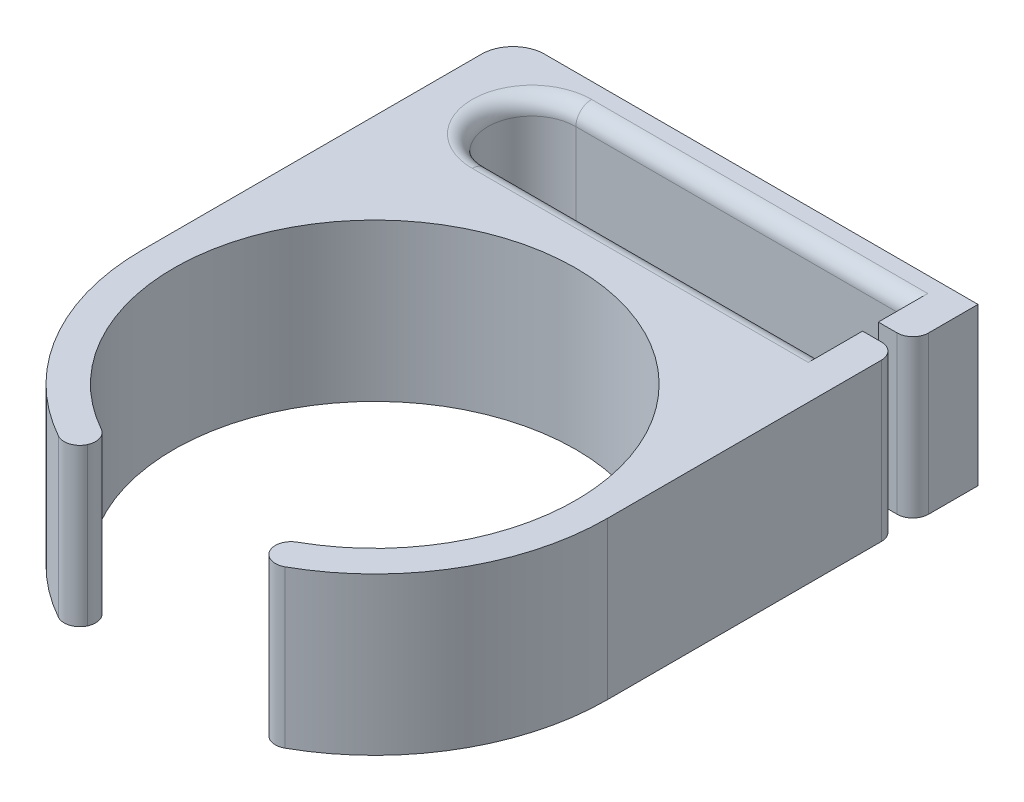
ISO-10303-21;
HEADER;
FILE_DESCRIPTION(('STEP AP214'),'2;1');
FILE_NAME('part.step','',(''),(''),'','','');
FILE_SCHEMA(('AUTOMOTIVE_DESIGN { 1 0 10303 214 1 1 1 1 }'));
ENDSEC;
DATA;
#1=APPLICATION_CONTEXT('core data for automotive mechanical design processes');
#2=APPLICATION_PROTOCOL_DEFINITION('international standard','automotive_design',2000,#1);
#3=PRODUCT_CONTEXT('',#1,'mechanical');
#4=PRODUCT('Part','Part','',(#3));
#5=PRODUCT_RELATED_PRODUCT_CATEGORY('part','',(#4));
#6=PRODUCT_DEFINITION_FORMATION('','',#4);
#7=PRODUCT_DEFINITION_CONTEXT('part definition',#1,'design');
#8=PRODUCT_DEFINITION('design','',#6,#7);
#9=PRODUCT_DEFINITION_SHAPE('','',#8);
#10=(LENGTH_UNIT() NAMED_UNIT(*) SI_UNIT(.MILLI.,.METRE.));
#11=(NAMED_UNIT(*) PLANE_ANGLE_UNIT() SI_UNIT($,.RADIAN.));
#12=(NAMED_UNIT(*) SI_UNIT($,.STERADIAN.) SOLID_ANGLE_UNIT());
#13=UNCERTAINTY_MEASURE_WITH_UNIT(LENGTH_MEASURE(1.E-05),#10,'distance_accuracy_value','');
#14=(GEOMETRIC_REPRESENTATION_CONTEXT(3) GLOBAL_UNCERTAINTY_ASSIGNED_CONTEXT((#13)) GLOBAL_UNIT_ASSIGNED_CONTEXT((#10,
#11,#12)) REPRESENTATION_CONTEXT('',''));
#15=CARTESIAN_POINT('',(0.,0.,0.));
#16=DIRECTION('',(0.,0.,1.));
#17=DIRECTION('',(1.,0.,0.));
#18=AXIS2_PLACEMENT_3D('',#15,#16,#17);
#19=CARTESIAN_POINT('',(0.,10.,-21.6));
#20=DIRECTION('',(0.,0.,1.));
#21=DIRECTION('',(1.,0.,0.));
#22=AXIS2_PLACEMENT_3D('',#19,#20,#21);
#23=PLANE('',#22);
#24=DIRECTION('',(0.,-1.,0.));
#25=VECTOR('',#24,1.);
#26=CARTESIAN_POINT('',(-8.8,10.,-21.6));
#27=LINE('',#26,#25);
#28=CARTESIAN_POINT('',(-8.8,9.,-21.6));
#29=VERTEX_POINT('',#28);
#30=CARTESIAN_POINT('',(-8.8,0.999999999999999,-21.6));
#31=VERTEX_POINT('',#30);
#32=EDGE_CURVE('E275',#29,#31,#27,.T.);
#33=ORIENTED_EDGE('',*,*,#32,.T.);
#34=DIRECTION('',(-1.,0.,0.));
#35=VECTOR('',#34,1.);
#36=CARTESIAN_POINT('',(12.6,1.,-21.6));
#37=LINE('',#36,#35);
#38=CARTESIAN_POINT('',(12.6,0.999999999999999,-21.6));
#39=VERTEX_POINT('',#38);
#40=EDGE_CURVE('E381',#31,#39,#37,.F.);
#41=ORIENTED_EDGE('',*,*,#40,.T.);
#42=DIRECTION('',(0.,-1.,0.));
#43=VECTOR('',#42,1.);
#44=CARTESIAN_POINT('',(12.6,10.,-21.6));
#45=LINE('',#44,#43);
#46=CARTESIAN_POINT('',(12.6,9.,-21.6));
#47=VERTEX_POINT('',#46);
#48=EDGE_CURVE('E232',#47,#39,#45,.T.);
#49=ORIENTED_EDGE('',*,*,#48,.F.);
#50=DIRECTION('',(-1.,0.,0.));
#51=VECTOR('',#50,1.);
#52=CARTESIAN_POINT('',(0.,9.,-21.6));
#53=LINE('',#52,#51);
#54=EDGE_CURVE('E377',#47,#29,#53,.T.);
#55=ORIENTED_EDGE('',*,*,#54,.T.);
#56=EDGE_LOOP('',(#33,#41,#49,#55));
#57=FACE_BOUND('',#56,.T.);
#58=ADVANCED_FACE('F41',(#57),#23,.T.);
#59=CARTESIAN_POINT('',(12.6,10.,0.));
#60=DIRECTION('',(-1.,0.,0.));
#61=DIRECTION('',(0.,0.,1.));
#62=AXIS2_PLACEMENT_3D('',#59,#60,#61);
#63=PLANE('',#62);
#64=DIRECTION('',(0.,0.,-1.));
#65=VECTOR('',#64,1.);
#66=CARTESIAN_POINT('',(12.6,0.,0.));
#67=LINE('',#66,#65);
#68=CARTESIAN_POINT('',(12.6,0.,-19.4531602214473));
#69=VERTEX_POINT('',#68);
#70=CARTESIAN_POINT('',(12.6,0.,-22.6));
#71=VERTEX_POINT('',#70);
#72=EDGE_CURVE('E230',#69,#71,#67,.T.);
#73=ORIENTED_EDGE('',*,*,#72,.F.);
#74=DIRECTION('',(0.,-1.,0.));
#75=VECTOR('',#74,1.);
#76=CARTESIAN_POINT('',(12.6,10.,-19.4531602214473));
#77=LINE('',#76,#75);
#78=CARTESIAN_POINT('',(12.6,10.,-19.4531602214473));
#79=VERTEX_POINT('',#78);
#80=EDGE_CURVE('E215',#79,#69,#77,.T.);
#81=ORIENTED_EDGE('',*,*,#80,.F.);
#82=DIRECTION('',(0.,0.,-1.));
#83=VECTOR('',#82,1.);
#84=CARTESIAN_POINT('',(12.6,10.,0.));
#85=LINE('',#84,#83);
#86=CARTESIAN_POINT('',(12.6,10.,-22.6));
#87=VERTEX_POINT('',#86);
#88=EDGE_CURVE('E224',#79,#87,#85,.T.);
#89=ORIENTED_EDGE('',*,*,#88,.T.);
#90=CARTESIAN_POINT('',(12.6,9.,-22.6));
#91=DIRECTION('',(-1.,0.,0.));
#92=DIRECTION('',(0.,0.,1.));
#93=AXIS2_PLACEMENT_3D('',#90,#91,#92);
#94=CIRCLE('',#93,1.);
#95=EDGE_CURVE('E451',#87,#47,#94,.F.);
#96=ORIENTED_EDGE('',*,*,#95,.T.);
#97=ORIENTED_EDGE('',*,*,#48,.T.);
#98=CARTESIAN_POINT('',(12.6,1.,-22.6));
#99=DIRECTION('',(-1.,0.,0.));
#100=DIRECTION('',(0.,0.,1.));
#101=AXIS2_PLACEMENT_3D('',#98,#99,#100);
#102=CIRCLE('',#101,1.);
#103=EDGE_CURVE('E448',#39,#71,#102,.F.);
#104=ORIENTED_EDGE('',*,*,#103,.T.);
#105=EDGE_LOOP('',(#73,#81,#89,#96,#97,#104));
#106=FACE_BOUND('',#105,.T.);
#107=ADVANCED_FACE('F227',(#106),#63,.T.);
#108=CARTESIAN_POINT('',(0.,10.,-19.4531602214473));
#109=DIRECTION('',(0.,0.,1.));
#110=DIRECTION('',(1.,0.,0.));
#111=AXIS2_PLACEMENT_3D('',#108,#109,#110);
#112=PLANE('',#111);
#113=DIRECTION('',(-1.,0.,0.));
#114=VECTOR('',#113,1.);
#115=CARTESIAN_POINT('',(0.,0.,-19.4531602214473));
#116=LINE('',#115,#114);
#117=CARTESIAN_POINT('',(13.8,0.,-19.4531602214473));
#118=VERTEX_POINT('',#117);
#119=EDGE_CURVE('E278',#118,#69,#116,.T.);
#120=ORIENTED_EDGE('',*,*,#119,.F.);
#121=DIRECTION('',(0.,-1.,0.));
#122=VECTOR('',#121,1.);
#123=CARTESIAN_POINT('',(13.8,10.,-19.4531602214473));
#124=LINE('',#123,#122);
#125=CARTESIAN_POINT('',(13.8,10.,-19.4531602214473));
#126=VERTEX_POINT('',#125);
#127=EDGE_CURVE('E218',#118,#126,#124,.F.);
#128=ORIENTED_EDGE('',*,*,#127,.T.);
#129=DIRECTION('',(-1.,0.,0.));
#130=VECTOR('',#129,1.);
#131=CARTESIAN_POINT('',(0.,10.,-19.4531602214473));
#132=LINE('',#131,#130);
#133=EDGE_CURVE('E211',#126,#79,#132,.T.);
#134=ORIENTED_EDGE('',*,*,#133,.T.);
#135=ORIENTED_EDGE('',*,*,#80,.T.);
#136=EDGE_LOOP('',(#120,#128,#134,#135));
#137=FACE_BOUND('',#136,.T.);
#138=ADVANCED_FACE('F214',(#137),#112,.T.);
#139=CARTESIAN_POINT('',(14.8,10.,0.));
#140=DIRECTION('',(1.,0.,0.));
#141=DIRECTION('',(0.,0.,-1.));
#142=AXIS2_PLACEMENT_3D('',#139,#140,#141);
#143=PLANE('',#142);
#144=DIRECTION('',(0.,0.,1.));
#145=VECTOR('',#144,1.);
#146=CARTESIAN_POINT('',(14.8,10.,0.));
#147=LINE('',#146,#145);
#148=CARTESIAN_POINT('',(14.8,10.,-23.6));
#149=VERTEX_POINT('',#148);
#150=CARTESIAN_POINT('',(14.8,10.,-20.4531602214473));
#151=VERTEX_POINT('',#150);
#152=EDGE_CURVE('E223',#149,#151,#147,.T.);
#153=ORIENTED_EDGE('',*,*,#152,.T.);
#154=DIRECTION('',(0.,-1.,0.));
#155=VECTOR('',#154,1.);
#156=CARTESIAN_POINT('',(14.8,10.,-20.4531602214473));
#157=LINE('',#156,#155);
#158=CARTESIAN_POINT('',(14.8,0.,-20.4531602214473));
#159=VERTEX_POINT('',#158);
#160=EDGE_CURVE('E421',#151,#159,#157,.T.);
#161=ORIENTED_EDGE('',*,*,#160,.T.);
#162=DIRECTION('',(0.,0.,1.));
#163=VECTOR('',#162,1.);
#164=CARTESIAN_POINT('',(14.8,0.,0.));
#165=LINE('',#164,#163);
#166=CARTESIAN_POINT('',(14.8,0.,-23.6));
#167=VERTEX_POINT('',#166);
#168=EDGE_CURVE('E282',#167,#159,#165,.T.);
#169=ORIENTED_EDGE('',*,*,#168,.F.);
#170=DIRECTION('',(0.,-1.,0.));
#171=VECTOR('',#170,1.);
#172=CARTESIAN_POINT('',(14.8,10.,-23.6));
#173=LINE('',#172,#171);
#174=EDGE_CURVE('E233',#149,#167,#173,.T.);
#175=ORIENTED_EDGE('',*,*,#174,.F.);
#176=EDGE_LOOP('',(#153,#161,#169,#175));
#177=FACE_BOUND('',#176,.T.);
#178=ADVANCED_FACE('F556',(#177),#143,.T.);
#179=CARTESIAN_POINT('',(0.,10.,-23.6));
#180=DIRECTION('',(0.,0.,-1.));
#181=DIRECTION('',(-1.,0.,0.));
#182=AXIS2_PLACEMENT_3D('',#179,#180,#181);
#183=PLANE('',#182);
#184=DIRECTION('',(1.,0.,0.));
#185=VECTOR('',#184,1.);
#186=CARTESIAN_POINT('',(0.,0.,-23.6));
#187=LINE('',#186,#185);
#188=CARTESIAN_POINT('',(-12.8,0.,-23.6));
#189=VERTEX_POINT('',#188);
#190=EDGE_CURVE('E286',#189,#167,#187,.T.);
#191=ORIENTED_EDGE('',*,*,#190,.F.);
#192=DIRECTION('',(0.,-1.,0.));
#193=VECTOR('',#192,1.);
#194=CARTESIAN_POINT('',(-12.8,10.,-23.6));
#195=LINE('',#194,#193);
#196=CARTESIAN_POINT('',(-12.8,10.,-23.6));
#197=VERTEX_POINT('',#196);
#198=EDGE_CURVE('E342',#189,#197,#195,.F.);
#199=ORIENTED_EDGE('',*,*,#198,.T.);
#200=DIRECTION('',(1.,0.,0.));
#201=VECTOR('',#200,1.);
#202=CARTESIAN_POINT('',(0.,10.,-23.6));
#203=LINE('',#202,#201);
#204=EDGE_CURVE('E249',#197,#149,#203,.T.);
#205=ORIENTED_EDGE('',*,*,#204,.T.);
#206=ORIENTED_EDGE('',*,*,#174,.T.);
#207=EDGE_LOOP('',(#191,#199,#205,#206));
#208=FACE_BOUND('',#207,.T.);
#209=ADVANCED_FACE('F560',(#208),#183,.T.);
#210=CARTESIAN_POINT('',(-14.8,10.,0.));
#211=DIRECTION('',(-1.,0.,0.));
#212=DIRECTION('',(0.,0.,1.));
#213=AXIS2_PLACEMENT_3D('',#210,#211,#212);
#214=PLANE('',#213);
#215=DIRECTION('',(0.,0.,-1.));
#216=VECTOR('',#215,1.);
#217=CARTESIAN_POINT('',(-14.8,10.,0.));
#218=LINE('',#217,#216);
#219=CARTESIAN_POINT('',(-14.8,10.,0.));
#220=VERTEX_POINT('',#219);
#221=CARTESIAN_POINT('',(-14.8,10.,-21.6));
#222=VERTEX_POINT('',#221);
#223=EDGE_CURVE('E252',#220,#222,#218,.T.);
#224=ORIENTED_EDGE('',*,*,#223,.T.);
#225=DIRECTION('',(0.,-1.,0.));
#226=VECTOR('',#225,1.);
#227=CARTESIAN_POINT('',(-14.8,10.,-21.6));
#228=LINE('',#227,#226);
#229=CARTESIAN_POINT('',(-14.8,0.,-21.6));
#230=VERTEX_POINT('',#229);
#231=EDGE_CURVE('E335',#222,#230,#228,.T.);
#232=ORIENTED_EDGE('',*,*,#231,.T.);
#233=DIRECTION('',(0.,0.,-1.));
#234=VECTOR('',#233,1.);
#235=CARTESIAN_POINT('',(-14.8,0.,0.));
#236=LINE('',#235,#234);
#237=CARTESIAN_POINT('',(-14.8,0.,0.));
#238=VERTEX_POINT('',#237);
#239=EDGE_CURVE('E289',#238,#230,#236,.T.);
#240=ORIENTED_EDGE('',*,*,#239,.F.);
#241=DIRECTION('',(0.,-1.,0.));
#242=VECTOR('',#241,1.);
#243=CARTESIAN_POINT('',(-14.8,10.,0.));
#244=LINE('',#243,#242);
#245=EDGE_CURVE('E326',#220,#238,#244,.T.);
#246=ORIENTED_EDGE('',*,*,#245,.F.);
#247=EDGE_LOOP('',(#224,#232,#240,#246));
#248=FACE_BOUND('',#247,.T.);
#249=ADVANCED_FACE('F569',(#248),#214,.T.);
#250=CARTESIAN_POINT('',(0.,10.,0.));
#251=DIRECTION('',(0.,-1.,0.));
#252=DIRECTION('',(0.,0.,-1.));
#253=AXIS2_PLACEMENT_3D('',#250,#251,#252);
#254=CYLINDRICAL_SURFACE('',#253,14.8);
#255=CARTESIAN_POINT('',(0.,0.,0.));
#256=DIRECTION('',(0.,1.,0.));
#257=DIRECTION('',(0.,0.,1.));
#258=AXIS2_PLACEMENT_3D('',#255,#256,#257);
#259=CIRCLE('',#258,14.8);
#260=CARTESIAN_POINT('',(-7.21028908395557,0.,12.9248493734276));
#261=VERTEX_POINT('',#260);
#262=EDGE_CURVE('E293',#238,#261,#259,.T.);
#263=ORIENTED_EDGE('',*,*,#262,.T.);
#264=DIRECTION('',(0.,-1.,0.));
#265=VECTOR('',#264,1.);
#266=CARTESIAN_POINT('',(-7.21028908395557,10.,12.9248493734276));
#267=LINE('',#266,#265);
#268=CARTESIAN_POINT('',(-7.21028908395557,10.,12.9248493734276));
#269=VERTEX_POINT('',#268);
#270=EDGE_CURVE('E444',#261,#269,#267,.F.);
#271=ORIENTED_EDGE('',*,*,#270,.T.);
#272=CARTESIAN_POINT('',(0.,10.,0.));
#273=DIRECTION('',(0.,1.,0.));
#274=DIRECTION('',(0.,0.,1.));
#275=AXIS2_PLACEMENT_3D('',#272,#273,#274);
#276=CIRCLE('',#275,14.8);
#277=EDGE_CURVE('E256',#220,#269,#276,.T.);
#278=ORIENTED_EDGE('',*,*,#277,.F.);
#279=ORIENTED_EDGE('',*,*,#245,.T.);
#280=EDGE_LOOP('',(#263,#271,#278,#279));
#281=FACE_BOUND('',#280,.T.);
#282=ADVANCED_FACE('F572',(#281),#254,.T.);
#283=CARTESIAN_POINT('',(0.,10.,0.));
#284=DIRECTION('',(0.,-1.,0.));
#285=DIRECTION('',(0.,0.,-1.));
#286=AXIS2_PLACEMENT_3D('',#283,#284,#285);
#287=CYLINDRICAL_SURFACE('',#286,12.8);
#288=CARTESIAN_POINT('',(0.,0.,0.));
#289=DIRECTION('',(0.,1.,0.));
#290=DIRECTION('',(0.,0.,1.));
#291=AXIS2_PLACEMENT_3D('',#288,#289,#290);
#292=CIRCLE('',#291,12.8);
#293=CARTESIAN_POINT('',(6.23592569423185,0.,11.1782481067482));
#294=VERTEX_POINT('',#293);
#295=CARTESIAN_POINT('',(-6.23592569423184,0.,11.1782481067482));
#296=VERTEX_POINT('',#295);
#297=EDGE_CURVE('E297',#294,#296,#292,.T.);
#298=ORIENTED_EDGE('',*,*,#297,.F.);
#299=DIRECTION('',(0.,-1.,0.));
#300=VECTOR('',#299,1.);
#301=CARTESIAN_POINT('',(6.23592569423185,10.,11.1782481067482));
#302=LINE('',#301,#300);
#303=CARTESIAN_POINT('',(6.23592569423185,10.,11.1782481067482));
#304=VERTEX_POINT('',#303);
#305=EDGE_CURVE('E437',#294,#304,#302,.F.);
#306=ORIENTED_EDGE('',*,*,#305,.T.);
#307=CARTESIAN_POINT('',(0.,10.,0.));
#308=DIRECTION('',(0.,1.,0.));
#309=DIRECTION('',(0.,0.,1.));
#310=AXIS2_PLACEMENT_3D('',#307,#308,#309);
#311=CIRCLE('',#310,12.8);
#312=CARTESIAN_POINT('',(-6.23592569423184,10.,11.1782481067482));
#313=VERTEX_POINT('',#312);
#314=EDGE_CURVE('E260',#304,#313,#311,.T.);
#315=ORIENTED_EDGE('',*,*,#314,.T.);
#316=DIRECTION('',(0.,-1.,0.));
#317=VECTOR('',#316,1.);
#318=CARTESIAN_POINT('',(-6.23592569423184,10.,11.1782481067482));
#319=LINE('',#318,#317);
#320=EDGE_CURVE('E434',#313,#296,#319,.T.);
#321=ORIENTED_EDGE('',*,*,#320,.T.);
#322=EDGE_LOOP('',(#298,#306,#315,#321));
#323=FACE_BOUND('',#322,.T.);
#324=ADVANCED_FACE('F488',(#323),#287,.F.);
#325=CARTESIAN_POINT('',(7.21028908395558,10.,12.9248493734276));
#326=VERTEX_POINT('',#325);
#327=CARTESIAN_POINT('',(14.8,10.,0.));
#328=VERTEX_POINT('',#327);
#329=EDGE_CURVE('E261',#326,#328,#276,.T.);
#330=ORIENTED_EDGE('',*,*,#329,.F.);
#331=DIRECTION('',(0.,-1.,0.));
#332=VECTOR('',#331,1.);
#333=CARTESIAN_POINT('',(7.21028908395558,10.,12.9248493734276));
#334=LINE('',#333,#332);
#335=CARTESIAN_POINT('',(7.21028908395558,0.,12.9248493734276));
#336=VERTEX_POINT('',#335);
#337=EDGE_CURVE('E441',#326,#336,#334,.T.);
#338=ORIENTED_EDGE('',*,*,#337,.T.);
#339=CARTESIAN_POINT('',(14.8,0.,0.));
#340=VERTEX_POINT('',#339);
#341=EDGE_CURVE('E298',#336,#340,#259,.T.);
#342=ORIENTED_EDGE('',*,*,#341,.T.);
#343=DIRECTION('',(0.,-1.,0.));
#344=VECTOR('',#343,1.);
#345=CARTESIAN_POINT('',(14.8,10.,0.));
#346=LINE('',#345,#344);
#347=EDGE_CURVE('E322',#328,#340,#346,.T.);
#348=ORIENTED_EDGE('',*,*,#347,.F.);
#349=EDGE_LOOP('',(#330,#338,#342,#348));
#350=FACE_BOUND('',#349,.T.);
#351=ADVANCED_FACE('F499',(#350),#254,.T.);
#352=CARTESIAN_POINT('',(14.8,10.,0.));
#353=DIRECTION('',(-1.,0.,0.));
#354=DIRECTION('',(0.,0.,1.));
#355=AXIS2_PLACEMENT_3D('',#352,#353,#354);
#356=PLANE('',#355);
#357=DIRECTION('',(0.,0.,-1.));
#358=VECTOR('',#357,1.);
#359=CARTESIAN_POINT('',(14.8,0.,0.));
#360=LINE('',#359,#358);
#361=CARTESIAN_POINT('',(14.8,0.,-17.4531602214473));
#362=VERTEX_POINT('',#361);
#363=EDGE_CURVE('E302',#340,#362,#360,.T.);
#364=ORIENTED_EDGE('',*,*,#363,.T.);
#365=DIRECTION('',(0.,-1.,0.));
#366=VECTOR('',#365,1.);
#367=CARTESIAN_POINT('',(14.8,10.,-17.4531602214473));
#368=LINE('',#367,#366);
#369=CARTESIAN_POINT('',(14.8,10.,-17.4531602214473));
#370=VERTEX_POINT('',#369);
#371=EDGE_CURVE('E431',#362,#370,#368,.F.);
#372=ORIENTED_EDGE('',*,*,#371,.T.);
#373=DIRECTION('',(0.,0.,-1.));
#374=VECTOR('',#373,1.);
#375=CARTESIAN_POINT('',(14.8,10.,0.));
#376=LINE('',#375,#374);
#377=EDGE_CURVE('E265',#328,#370,#376,.T.);
#378=ORIENTED_EDGE('',*,*,#377,.F.);
#379=ORIENTED_EDGE('',*,*,#347,.T.);
#380=EDGE_LOOP('',(#364,#372,#378,#379));
#381=FACE_BOUND('',#380,.T.);
#382=ADVANCED_FACE('F508',(#381),#356,.F.);
#383=CARTESIAN_POINT('',(0.,10.,-18.4531602214473));
#384=DIRECTION('',(0.,0.,1.));
#385=DIRECTION('',(1.,0.,0.));
#386=AXIS2_PLACEMENT_3D('',#383,#384,#385);
#387=PLANE('',#386);
#388=DIRECTION('',(-1.,0.,0.));
#389=VECTOR('',#388,1.);
#390=CARTESIAN_POINT('',(0.,10.,-18.4531602214473));
#391=LINE('',#390,#389);
#392=CARTESIAN_POINT('',(13.8,10.,-18.4531602214473));
#393=VERTEX_POINT('',#392);
#394=CARTESIAN_POINT('',(12.6,10.,-18.4531602214473));
#395=VERTEX_POINT('',#394);
#396=EDGE_CURVE('E269',#393,#395,#391,.T.);
#397=ORIENTED_EDGE('',*,*,#396,.F.);
#398=DIRECTION('',(0.,-1.,0.));
#399=VECTOR('',#398,1.);
#400=CARTESIAN_POINT('',(13.8,10.,-18.4531602214473));
#401=LINE('',#400,#399);
#402=CARTESIAN_POINT('',(13.8,0.,-18.4531602214473));
#403=VERTEX_POINT('',#402);
#404=EDGE_CURVE('E427',#393,#403,#401,.T.);
#405=ORIENTED_EDGE('',*,*,#404,.T.);
#406=DIRECTION('',(-1.,0.,0.));
#407=VECTOR('',#406,1.);
#408=CARTESIAN_POINT('',(0.,0.,-18.4531602214473));
#409=LINE('',#408,#407);
#410=CARTESIAN_POINT('',(12.6,0.,-18.4531602214473));
#411=VERTEX_POINT('',#410);
#412=EDGE_CURVE('E243',#403,#411,#409,.T.);
#413=ORIENTED_EDGE('',*,*,#412,.T.);
#414=DIRECTION('',(0.,-1.,0.));
#415=VECTOR('',#414,1.);
#416=CARTESIAN_POINT('',(12.6,10.,-18.4531602214473));
#417=LINE('',#416,#415);
#418=EDGE_CURVE('E318',#395,#411,#417,.T.);
#419=ORIENTED_EDGE('',*,*,#418,.F.);
#420=EDGE_LOOP('',(#397,#405,#413,#419));
#421=FACE_BOUND('',#420,.T.);
#422=ADVANCED_FACE('F517',(#421),#387,.F.);
#423=CARTESIAN_POINT('',(12.6,10.,0.));
#424=DIRECTION('',(1.,0.,0.));
#425=DIRECTION('',(0.,0.,-1.));
#426=AXIS2_PLACEMENT_3D('',#423,#424,#425);
#427=PLANE('',#426);
#428=DIRECTION('',(0.,0.,1.));
#429=VECTOR('',#428,1.);
#430=CARTESIAN_POINT('',(12.6,0.,0.));
#431=LINE('',#430,#429);
#432=CARTESIAN_POINT('',(12.6,0.,-15.));
#433=VERTEX_POINT('',#432);
#434=EDGE_CURVE('E240',#411,#433,#431,.T.);
#435=ORIENTED_EDGE('',*,*,#434,.T.);
#436=CARTESIAN_POINT('',(12.6,0.999999999999999,-15.));
#437=DIRECTION('',(1.,0.,0.));
#438=DIRECTION('',(0.,0.,-1.));
#439=AXIS2_PLACEMENT_3D('',#436,#437,#438);
#440=CIRCLE('',#439,1.);
#441=CARTESIAN_POINT('',(12.6,0.999999999999999,-16.));
#442=VERTEX_POINT('',#441);
#443=EDGE_CURVE('E51',#433,#442,#440,.T.);
#444=ORIENTED_EDGE('',*,*,#443,.T.);
#445=DIRECTION('',(0.,-1.,0.));
#446=VECTOR('',#445,1.);
#447=CARTESIAN_POINT('',(12.6,10.,-16.));
#448=LINE('',#447,#446);
#449=CARTESIAN_POINT('',(12.6,9.,-16.));
#450=VERTEX_POINT('',#449);
#451=EDGE_CURVE('E315',#450,#442,#448,.T.);
#452=ORIENTED_EDGE('',*,*,#451,.F.);
#453=CARTESIAN_POINT('',(12.6,9.,-15.));
#454=DIRECTION('',(1.,0.,0.));
#455=DIRECTION('',(0.,0.,-1.));
#456=AXIS2_PLACEMENT_3D('',#453,#454,#455);
#457=CIRCLE('',#456,1.);
#458=CARTESIAN_POINT('',(12.6,10.,-15.));
#459=VERTEX_POINT('',#458);
#460=EDGE_CURVE('E11',#450,#459,#457,.T.);
#461=ORIENTED_EDGE('',*,*,#460,.T.);
#462=DIRECTION('',(0.,0.,1.));
#463=VECTOR('',#462,1.);
#464=CARTESIAN_POINT('',(12.6,10.,0.));
#465=LINE('',#464,#463);
#466=EDGE_CURVE('E272',#395,#459,#465,.T.);
#467=ORIENTED_EDGE('',*,*,#466,.F.);
#468=ORIENTED_EDGE('',*,*,#418,.T.);
#469=EDGE_LOOP('',(#435,#444,#452,#461,#467,#468));
#470=FACE_BOUND('',#469,.T.);
#471=ADVANCED_FACE('F520',(#470),#427,.F.);
#472=CARTESIAN_POINT('',(0.,10.,-16.));
#473=DIRECTION('',(0.,0.,1.));
#474=DIRECTION('',(1.,0.,0.));
#475=AXIS2_PLACEMENT_3D('',#472,#473,#474);
#476=PLANE('',#475);
#477=ORIENTED_EDGE('',*,*,#451,.T.);
#478=DIRECTION('',(-1.,0.,0.));
#479=VECTOR('',#478,1.);
#480=CARTESIAN_POINT('',(0.,0.999999999999999,-16.));
#481=LINE('',#480,#479);
#482=CARTESIAN_POINT('',(-8.8,0.999999999999999,-16.));
#483=VERTEX_POINT('',#482);
#484=EDGE_CURVE('E418',#442,#483,#481,.T.);
#485=ORIENTED_EDGE('',*,*,#484,.T.);
#486=DIRECTION('',(0.,-1.,0.));
#487=VECTOR('',#486,1.);
#488=CARTESIAN_POINT('',(-8.8,10.,-16.));
#489=LINE('',#488,#487);
#490=CARTESIAN_POINT('',(-8.8,9.,-16.));
#491=VERTEX_POINT('',#490);
#492=EDGE_CURVE('E311',#491,#483,#489,.T.);
#493=ORIENTED_EDGE('',*,*,#492,.F.);
#494=DIRECTION('',(-1.,0.,0.));
#495=VECTOR('',#494,1.);
#496=CARTESIAN_POINT('',(12.6,9.,-16.));
#497=LINE('',#496,#495);
#498=EDGE_CURVE('E65',#491,#450,#497,.F.);
#499=ORIENTED_EDGE('',*,*,#498,.T.);
#500=EDGE_LOOP('',(#477,#485,#493,#499));
#501=FACE_BOUND('',#500,.T.);
#502=ADVANCED_FACE('F685',(#501),#476,.F.);
#503=CARTESIAN_POINT('',(-8.8,10.,-18.8));
#504=DIRECTION('',(0.,-1.,0.));
#505=DIRECTION('',(0.,0.,-1.));
#506=AXIS2_PLACEMENT_3D('',#503,#504,#505);
#507=CYLINDRICAL_SURFACE('',#506,2.8);
#508=ORIENTED_EDGE('',*,*,#492,.T.);
#509=CARTESIAN_POINT('',(-8.8,0.999999999999999,-18.8));
#510=DIRECTION('',(0.,1.,0.));
#511=DIRECTION('',(0.,0.,1.));
#512=AXIS2_PLACEMENT_3D('',#509,#510,#511);
#513=CIRCLE('',#512,2.8);
#514=EDGE_CURVE('E387',#483,#31,#513,.F.);
#515=ORIENTED_EDGE('',*,*,#514,.T.);
#516=ORIENTED_EDGE('',*,*,#32,.F.);
#517=CARTESIAN_POINT('',(-8.8,9.,-18.8));
#518=DIRECTION('',(0.,1.,0.));
#519=DIRECTION('',(0.,0.,1.));
#520=AXIS2_PLACEMENT_3D('',#517,#518,#519);
#521=CIRCLE('',#520,2.8);
#522=EDGE_CURVE('E384',#29,#491,#521,.T.);
#523=ORIENTED_EDGE('',*,*,#522,.T.);
#524=EDGE_LOOP('',(#508,#515,#516,#523));
#525=FACE_BOUND('',#524,.T.);
#526=ADVANCED_FACE('F678',(#525),#507,.F.);
#527=CARTESIAN_POINT('',(0.,10.,0.));
#528=DIRECTION('',(0.,1.,0.));
#529=DIRECTION('',(0.,0.,1.));
#530=AXIS2_PLACEMENT_3D('',#527,#528,#529);
#531=PLANE('',#530);
#532=DIRECTION('',(-1.,0.,0.));
#533=VECTOR('',#532,1.);
#534=CARTESIAN_POINT('',(0.,10.,-22.6));
#535=LINE('',#534,#533);
#536=CARTESIAN_POINT('',(-8.8,10.,-22.6));
#537=VERTEX_POINT('',#536);
#538=EDGE_CURVE('E237',#537,#87,#535,.F.);
#539=ORIENTED_EDGE('',*,*,#538,.T.);
#540=ORIENTED_EDGE('',*,*,#88,.F.);
#541=ORIENTED_EDGE('',*,*,#133,.F.);
#542=CARTESIAN_POINT('',(13.8,10.,-20.4531602214473));
#543=DIRECTION('',(0.,1.,0.));
#544=DIRECTION('',(0.,0.,1.));
#545=AXIS2_PLACEMENT_3D('',#542,#543,#544);
#546=CIRCLE('',#545,1.);
#547=EDGE_CURVE('E405',#126,#151,#546,.T.);
#548=ORIENTED_EDGE('',*,*,#547,.T.);
#549=ORIENTED_EDGE('',*,*,#152,.F.);
#550=ORIENTED_EDGE('',*,*,#204,.F.);
#551=CARTESIAN_POINT('',(-12.8,10.,-21.6));
#552=DIRECTION('',(0.,1.,0.));
#553=DIRECTION('',(0.,0.,1.));
#554=AXIS2_PLACEMENT_3D('',#551,#552,#553);
#555=CIRCLE('',#554,2.);
#556=EDGE_CURVE('E345',#197,#222,#555,.T.);
#557=ORIENTED_EDGE('',*,*,#556,.T.);
#558=ORIENTED_EDGE('',*,*,#223,.F.);
#559=ORIENTED_EDGE('',*,*,#277,.T.);
#560=CARTESIAN_POINT('',(-6.72310738909371,10.,12.0515487400879));
#561=DIRECTION('',(0.,1.,0.));
#562=DIRECTION('',(0.,0.,1.));
#563=AXIS2_PLACEMENT_3D('',#560,#561,#562);
#564=CIRCLE('',#563,1.);
#565=CARTESIAN_POINT('',(-5.81679960205706,10.,12.4741670018286));
#566=VERTEX_POINT('',#565);
#567=EDGE_CURVE('E393',#269,#566,#564,.T.);
#568=ORIENTED_EDGE('',*,*,#567,.T.);
#569=CARTESIAN_POINT('',(-6.72310738909371,10.,12.0515487400879));
#570=DIRECTION('',(0.,1.,0.));
#571=DIRECTION('',(0.,0.,1.));
#572=AXIS2_PLACEMENT_3D('',#569,#570,#571);
#573=CIRCLE('',#572,1.);
#574=EDGE_CURVE('E390',#566,#313,#573,.T.);
#575=ORIENTED_EDGE('',*,*,#574,.T.);
#576=ORIENTED_EDGE('',*,*,#314,.F.);
#577=CARTESIAN_POINT('',(6.72310738909372,10.,12.0515487400879));
#578=DIRECTION('',(0.,1.,0.));
#579=DIRECTION('',(0.,0.,1.));
#580=AXIS2_PLACEMENT_3D('',#577,#578,#579);
#581=CIRCLE('',#580,1.);
#582=CARTESIAN_POINT('',(5.81679960205707,10.,12.4741670018286));
#583=VERTEX_POINT('',#582);
#584=EDGE_CURVE('E399',#304,#583,#581,.T.);
#585=ORIENTED_EDGE('',*,*,#584,.T.);
#586=CARTESIAN_POINT('',(6.72310738909371,10.,12.0515487400879));
#587=DIRECTION('',(0.,1.,0.));
#588=DIRECTION('',(0.,0.,1.));
#589=AXIS2_PLACEMENT_3D('',#586,#587,#588);
#590=CIRCLE('',#589,1.);
#591=EDGE_CURVE('E396',#583,#326,#590,.T.);
#592=ORIENTED_EDGE('',*,*,#591,.T.);
#593=ORIENTED_EDGE('',*,*,#329,.T.);
#594=ORIENTED_EDGE('',*,*,#377,.T.);
#595=CARTESIAN_POINT('',(13.8,10.,-17.4531602214473));
#596=DIRECTION('',(0.,1.,0.));
#597=DIRECTION('',(0.,0.,1.));
#598=AXIS2_PLACEMENT_3D('',#595,#596,#597);
#599=CIRCLE('',#598,1.);
#600=EDGE_CURVE('E402',#370,#393,#599,.T.);
#601=ORIENTED_EDGE('',*,*,#600,.T.);
#602=ORIENTED_EDGE('',*,*,#396,.T.);
#603=ORIENTED_EDGE('',*,*,#466,.T.);
#604=DIRECTION('',(-1.,0.,0.));
#605=VECTOR('',#604,1.);
#606=CARTESIAN_POINT('',(-8.8,10.,-15.));
#607=LINE('',#606,#605);
#608=CARTESIAN_POINT('',(-8.8,10.,-15.));
#609=VERTEX_POINT('',#608);
#610=EDGE_CURVE('E408',#459,#609,#607,.T.);
#611=ORIENTED_EDGE('',*,*,#610,.T.);
#612=CARTESIAN_POINT('',(-8.8,10.,-18.8));
#613=DIRECTION('',(0.,1.,0.));
#614=DIRECTION('',(0.,0.,1.));
#615=AXIS2_PLACEMENT_3D('',#612,#613,#614);
#616=CIRCLE('',#615,3.8);
#617=EDGE_CURVE('E411',#609,#537,#616,.F.);
#618=ORIENTED_EDGE('',*,*,#617,.T.);
#619=EDGE_LOOP('',(#539,#540,#541,#548,#549,#550,#557,#558,#559,#568,#575,#576,#585,#592,#593,
#594,#601,#602,#603,#611,#618));
#620=FACE_BOUND('',#619,.T.);
#621=ADVANCED_FACE('F235',(#620),#531,.T.);
#622=CARTESIAN_POINT('',(0.,0.,0.));
#623=DIRECTION('',(0.,1.,0.));
#624=DIRECTION('',(0.,0.,1.));
#625=AXIS2_PLACEMENT_3D('',#622,#623,#624);
#626=PLANE('',#625);
#627=ORIENTED_EDGE('',*,*,#72,.T.);
#628=DIRECTION('',(-1.,0.,0.));
#629=VECTOR('',#628,1.);
#630=CARTESIAN_POINT('',(-8.8,0.,-22.6));
#631=LINE('',#630,#629);
#632=CARTESIAN_POINT('',(-8.8,0.,-22.6));
#633=VERTEX_POINT('',#632);
#634=EDGE_CURVE('E373',#71,#633,#631,.T.);
#635=ORIENTED_EDGE('',*,*,#634,.T.);
#636=CARTESIAN_POINT('',(-8.8,0.,-18.8));
#637=DIRECTION('',(0.,1.,0.));
#638=DIRECTION('',(0.,0.,1.));
#639=AXIS2_PLACEMENT_3D('',#636,#637,#638);
#640=CIRCLE('',#639,3.8);
#641=CARTESIAN_POINT('',(-8.8,0.,-15.));
#642=VERTEX_POINT('',#641);
#643=EDGE_CURVE('E370',#633,#642,#640,.T.);
#644=ORIENTED_EDGE('',*,*,#643,.T.);
#645=DIRECTION('',(-1.,0.,0.));
#646=VECTOR('',#645,1.);
#647=CARTESIAN_POINT('',(0.,0.,-15.));
#648=LINE('',#647,#646);
#649=EDGE_CURVE('E366',#642,#433,#648,.F.);
#650=ORIENTED_EDGE('',*,*,#649,.T.);
#651=ORIENTED_EDGE('',*,*,#434,.F.);
#652=ORIENTED_EDGE('',*,*,#412,.F.);
#653=CARTESIAN_POINT('',(13.8,0.,-17.4531602214473));
#654=DIRECTION('',(0.,1.,0.));
#655=DIRECTION('',(0.,0.,1.));
#656=AXIS2_PLACEMENT_3D('',#653,#654,#655);
#657=CIRCLE('',#656,1.);
#658=EDGE_CURVE('E360',#403,#362,#657,.F.);
#659=ORIENTED_EDGE('',*,*,#658,.T.);
#660=ORIENTED_EDGE('',*,*,#363,.F.);
#661=ORIENTED_EDGE('',*,*,#341,.F.);
#662=CARTESIAN_POINT('',(6.72310738909371,0.,12.0515487400879));
#663=DIRECTION('',(0.,1.,0.));
#664=DIRECTION('',(0.,0.,1.));
#665=AXIS2_PLACEMENT_3D('',#662,#663,#664);
#666=CIRCLE('',#665,1.);
#667=CARTESIAN_POINT('',(5.81679960205707,0.,12.4741670018286));
#668=VERTEX_POINT('',#667);
#669=EDGE_CURVE('E354',#336,#668,#666,.F.);
#670=ORIENTED_EDGE('',*,*,#669,.T.);
#671=CARTESIAN_POINT('',(6.72310738909372,0.,12.0515487400879));
#672=DIRECTION('',(0.,1.,0.));
#673=DIRECTION('',(0.,0.,1.));
#674=AXIS2_PLACEMENT_3D('',#671,#672,#673);
#675=CIRCLE('',#674,1.);
#676=EDGE_CURVE('E357',#668,#294,#675,.F.);
#677=ORIENTED_EDGE('',*,*,#676,.T.);
#678=ORIENTED_EDGE('',*,*,#297,.T.);
#679=CARTESIAN_POINT('',(-6.72310738909371,0.,12.0515487400879));
#680=DIRECTION('',(0.,1.,0.));
#681=DIRECTION('',(0.,0.,1.));
#682=AXIS2_PLACEMENT_3D('',#679,#680,#681);
#683=CIRCLE('',#682,1.);
#684=CARTESIAN_POINT('',(-5.81679960205706,0.,12.4741670018286));
#685=VERTEX_POINT('',#684);
#686=EDGE_CURVE('E348',#296,#685,#683,.F.);
#687=ORIENTED_EDGE('',*,*,#686,.T.);
#688=CARTESIAN_POINT('',(-6.72310738909371,0.,12.0515487400879));
#689=DIRECTION('',(0.,1.,0.));
#690=DIRECTION('',(0.,0.,1.));
#691=AXIS2_PLACEMENT_3D('',#688,#689,#690);
#692=CIRCLE('',#691,1.);
#693=EDGE_CURVE('E351',#685,#261,#692,.F.);
#694=ORIENTED_EDGE('',*,*,#693,.T.);
#695=ORIENTED_EDGE('',*,*,#262,.F.);
#696=ORIENTED_EDGE('',*,*,#239,.T.);
#697=CARTESIAN_POINT('',(-12.8,0.,-21.6));
#698=DIRECTION('',(0.,1.,0.));
#699=DIRECTION('',(0.,0.,1.));
#700=AXIS2_PLACEMENT_3D('',#697,#698,#699);
#701=CIRCLE('',#700,2.);
#702=EDGE_CURVE('E339',#230,#189,#701,.F.);
#703=ORIENTED_EDGE('',*,*,#702,.T.);
#704=ORIENTED_EDGE('',*,*,#190,.T.);
#705=ORIENTED_EDGE('',*,*,#168,.T.);
#706=CARTESIAN_POINT('',(13.8,0.,-20.4531602214473));
#707=DIRECTION('',(0.,1.,0.));
#708=DIRECTION('',(0.,0.,1.));
#709=AXIS2_PLACEMENT_3D('',#706,#707,#708);
#710=CIRCLE('',#709,1.);
#711=EDGE_CURVE('E363',#159,#118,#710,.F.);
#712=ORIENTED_EDGE('',*,*,#711,.T.);
#713=ORIENTED_EDGE('',*,*,#119,.T.);
#714=EDGE_LOOP('',(#627,#635,#644,#650,#651,#652,#659,#660,#661,#670,#677,#678,#687,#694,#695,
#696,#703,#704,#705,#712,#713));
#715=FACE_BOUND('',#714,.T.);
#716=ADVANCED_FACE('F503',(#715),#626,.F.);
#717=CARTESIAN_POINT('',(-12.8,10.,-21.6));
#718=DIRECTION('',(0.,-1.,0.));
#719=DIRECTION('',(0.,0.,-1.));
#720=AXIS2_PLACEMENT_3D('',#717,#718,#719);
#721=CYLINDRICAL_SURFACE('',#720,2.);
#722=ORIENTED_EDGE('',*,*,#556,.F.);
#723=ORIENTED_EDGE('',*,*,#198,.F.);
#724=ORIENTED_EDGE('',*,*,#702,.F.);
#725=ORIENTED_EDGE('',*,*,#231,.F.);
#726=EDGE_LOOP('',(#722,#723,#724,#725));
#727=FACE_BOUND('',#726,.T.);
#728=ADVANCED_FACE('F566',(#727),#721,.T.);
#729=CARTESIAN_POINT('',(0.,0.999999999999999,-15.));
#730=DIRECTION('',(-1.,0.,0.));
#731=DIRECTION('',(0.,0.,1.));
#732=AXIS2_PLACEMENT_3D('',#729,#730,#731);
#733=CYLINDRICAL_SURFACE('',#732,1.);
#734=ORIENTED_EDGE('',*,*,#443,.F.);
#735=ORIENTED_EDGE('',*,*,#649,.F.);
#736=CARTESIAN_POINT('',(-8.8,0.999999999999999,-15.));
#737=DIRECTION('',(-1.,0.,0.));
#738=DIRECTION('',(0.,0.,1.));
#739=AXIS2_PLACEMENT_3D('',#736,#737,#738);
#740=CIRCLE('',#739,1.);
#741=EDGE_CURVE('E279',#483,#642,#740,.T.);
#742=ORIENTED_EDGE('',*,*,#741,.F.);
#743=ORIENTED_EDGE('',*,*,#484,.F.);
#744=EDGE_LOOP('',(#734,#735,#742,#743));
#745=FACE_BOUND('',#744,.T.);
#746=ADVANCED_FACE('F594',(#745),#733,.T.);
#747=CARTESIAN_POINT('',(-8.8,0.999999999999999,-18.8));
#748=DIRECTION('',(0.,1.,0.));
#749=DIRECTION('',(0.,0.,1.));
#750=AXIS2_PLACEMENT_3D('',#747,#748,#749);
#751=TOROIDAL_SURFACE('',#750,3.8,1.);
#752=ORIENTED_EDGE('',*,*,#741,.T.);
#753=ORIENTED_EDGE('',*,*,#643,.F.);
#754=CARTESIAN_POINT('',(-8.8,0.999999999999999,-22.6));
#755=DIRECTION('',(1.,0.,0.));
#756=DIRECTION('',(0.,0.,-1.));
#757=AXIS2_PLACEMENT_3D('',#754,#755,#756);
#758=CIRCLE('',#757,1.);
#759=EDGE_CURVE('E456',#31,#633,#758,.T.);
#760=ORIENTED_EDGE('',*,*,#759,.F.);
#761=ORIENTED_EDGE('',*,*,#514,.F.);
#762=EDGE_LOOP('',(#752,#753,#760,#761));
#763=FACE_BOUND('',#762,.T.);
#764=ADVANCED_FACE('F546',(#763),#751,.T.);
#765=CARTESIAN_POINT('',(0.,1.,-22.6));
#766=DIRECTION('',(1.,0.,0.));
#767=DIRECTION('',(0.,0.,-1.));
#768=AXIS2_PLACEMENT_3D('',#765,#766,#767);
#769=CYLINDRICAL_SURFACE('',#768,1.);
#770=ORIENTED_EDGE('',*,*,#103,.F.);
#771=ORIENTED_EDGE('',*,*,#40,.F.);
#772=ORIENTED_EDGE('',*,*,#759,.T.);
#773=ORIENTED_EDGE('',*,*,#634,.F.);
#774=EDGE_LOOP('',(#770,#771,#772,#773));
#775=FACE_BOUND('',#774,.T.);
#776=ADVANCED_FACE('F541',(#775),#769,.T.);
#777=CARTESIAN_POINT('',(0.,9.,-15.));
#778=DIRECTION('',(1.,0.,0.));
#779=DIRECTION('',(0.,0.,-1.));
#780=AXIS2_PLACEMENT_3D('',#777,#778,#779);
#781=CYLINDRICAL_SURFACE('',#780,1.);
#782=ORIENTED_EDGE('',*,*,#460,.F.);
#783=ORIENTED_EDGE('',*,*,#498,.F.);
#784=CARTESIAN_POINT('',(-8.8,9.,-15.));
#785=DIRECTION('',(-1.,0.,0.));
#786=DIRECTION('',(0.,0.,1.));
#787=AXIS2_PLACEMENT_3D('',#784,#785,#786);
#788=CIRCLE('',#787,1.);
#789=EDGE_CURVE('E459',#609,#491,#788,.T.);
#790=ORIENTED_EDGE('',*,*,#789,.F.);
#791=ORIENTED_EDGE('',*,*,#610,.F.);
#792=EDGE_LOOP('',(#782,#783,#790,#791));
#793=FACE_BOUND('',#792,.T.);
#794=ADVANCED_FACE('F526',(#793),#781,.T.);
#795=CARTESIAN_POINT('',(-8.8,9.,-18.8));
#796=DIRECTION('',(0.,1.,0.));
#797=DIRECTION('',(0.,0.,1.));
#798=AXIS2_PLACEMENT_3D('',#795,#796,#797);
#799=TOROIDAL_SURFACE('',#798,3.8,1.);
#800=ORIENTED_EDGE('',*,*,#789,.T.);
#801=ORIENTED_EDGE('',*,*,#522,.F.);
#802=CARTESIAN_POINT('',(-8.8,9.,-22.6));
#803=DIRECTION('',(1.,0.,0.));
#804=DIRECTION('',(0.,0.,-1.));
#805=AXIS2_PLACEMENT_3D('',#802,#803,#804);
#806=CIRCLE('',#805,1.);
#807=EDGE_CURVE('E463',#537,#29,#806,.T.);
#808=ORIENTED_EDGE('',*,*,#807,.F.);
#809=ORIENTED_EDGE('',*,*,#617,.F.);
#810=EDGE_LOOP('',(#800,#801,#808,#809));
#811=FACE_BOUND('',#810,.T.);
#812=ADVANCED_FACE('F530',(#811),#799,.T.);
#813=CARTESIAN_POINT('',(0.,9.,-22.6));
#814=DIRECTION('',(-1.,0.,0.));
#815=DIRECTION('',(0.,0.,1.));
#816=AXIS2_PLACEMENT_3D('',#813,#814,#815);
#817=CYLINDRICAL_SURFACE('',#816,1.);
#818=ORIENTED_EDGE('',*,*,#95,.F.);
#819=ORIENTED_EDGE('',*,*,#538,.F.);
#820=ORIENTED_EDGE('',*,*,#807,.T.);
#821=ORIENTED_EDGE('',*,*,#54,.F.);
#822=EDGE_LOOP('',(#818,#819,#820,#821));
#823=FACE_BOUND('',#822,.T.);
#824=ADVANCED_FACE('F533',(#823),#817,.T.);
#825=CARTESIAN_POINT('',(13.8,10.,-20.4531602214473));
#826=DIRECTION('',(0.,-1.,0.));
#827=DIRECTION('',(0.,0.,-1.));
#828=AXIS2_PLACEMENT_3D('',#825,#826,#827);
#829=CYLINDRICAL_SURFACE('',#828,1.);
#830=ORIENTED_EDGE('',*,*,#547,.F.);
#831=ORIENTED_EDGE('',*,*,#127,.F.);
#832=ORIENTED_EDGE('',*,*,#711,.F.);
#833=ORIENTED_EDGE('',*,*,#160,.F.);
#834=EDGE_LOOP('',(#830,#831,#832,#833));
#835=FACE_BOUND('',#834,.T.);
#836=ADVANCED_FACE('F550',(#835),#829,.T.);
#837=CARTESIAN_POINT('',(13.8,10.,-17.4531602214473));
#838=DIRECTION('',(0.,-1.,0.));
#839=DIRECTION('',(0.,0.,-1.));
#840=AXIS2_PLACEMENT_3D('',#837,#838,#839);
#841=CYLINDRICAL_SURFACE('',#840,1.);
#842=ORIENTED_EDGE('',*,*,#600,.F.);
#843=ORIENTED_EDGE('',*,*,#371,.F.);
#844=ORIENTED_EDGE('',*,*,#658,.F.);
#845=ORIENTED_EDGE('',*,*,#404,.F.);
#846=EDGE_LOOP('',(#842,#843,#844,#845));
#847=FACE_BOUND('',#846,.T.);
#848=ADVANCED_FACE('F512',(#847),#841,.T.);
#849=CARTESIAN_POINT('',(6.72310738909371,10.,12.0515487400879));
#850=DIRECTION('',(0.,-1.,0.));
#851=DIRECTION('',(0.,0.,-1.));
#852=AXIS2_PLACEMENT_3D('',#849,#850,#851);
#853=CYLINDRICAL_SURFACE('',#852,1.);
#854=ORIENTED_EDGE('',*,*,#337,.F.);
#855=ORIENTED_EDGE('',*,*,#591,.F.);
#856=DIRECTION('',(0.,-1.,0.));
#857=VECTOR('',#856,1.);
#858=CARTESIAN_POINT('',(5.81679960205707,10.,12.4741670018286));
#859=LINE('',#858,#857);
#860=EDGE_CURVE('E466',#668,#583,#859,.F.);
#861=ORIENTED_EDGE('',*,*,#860,.F.);
#862=ORIENTED_EDGE('',*,*,#669,.F.);
#863=EDGE_LOOP('',(#854,#855,#861,#862));
#864=FACE_BOUND('',#863,.T.);
#865=ADVANCED_FACE('F495',(#864),#853,.T.);
#866=CARTESIAN_POINT('',(6.72310738909372,10.,12.0515487400879));
#867=DIRECTION('',(0.,-1.,0.));
#868=DIRECTION('',(0.,0.,-1.));
#869=AXIS2_PLACEMENT_3D('',#866,#867,#868);
#870=CYLINDRICAL_SURFACE('',#869,1.);
#871=ORIENTED_EDGE('',*,*,#584,.F.);
#872=ORIENTED_EDGE('',*,*,#305,.F.);
#873=ORIENTED_EDGE('',*,*,#676,.F.);
#874=ORIENTED_EDGE('',*,*,#860,.T.);
#875=EDGE_LOOP('',(#871,#872,#873,#874));
#876=FACE_BOUND('',#875,.T.);
#877=ADVANCED_FACE('F490',(#876),#870,.T.);
#878=CARTESIAN_POINT('',(-6.72310738909371,10.,12.0515487400879));
#879=DIRECTION('',(0.,-1.,0.));
#880=DIRECTION('',(0.,0.,-1.));
#881=AXIS2_PLACEMENT_3D('',#878,#879,#880);
#882=CYLINDRICAL_SURFACE('',#881,1.);
#883=ORIENTED_EDGE('',*,*,#320,.F.);
#884=ORIENTED_EDGE('',*,*,#574,.F.);
#885=DIRECTION('',(0.,-1.,0.));
#886=VECTOR('',#885,1.);
#887=CARTESIAN_POINT('',(-5.81679960205706,10.,12.4741670018286));
#888=LINE('',#887,#886);
#889=EDGE_CURVE('E45',#685,#566,#888,.F.);
#890=ORIENTED_EDGE('',*,*,#889,.F.);
#891=ORIENTED_EDGE('',*,*,#686,.F.);
#892=EDGE_LOOP('',(#883,#884,#890,#891));
#893=FACE_BOUND('',#892,.T.);
#894=ADVANCED_FACE('F43',(#893),#882,.T.);
#895=CARTESIAN_POINT('',(-6.72310738909371,10.,12.0515487400879));
#896=DIRECTION('',(0.,-1.,0.));
#897=DIRECTION('',(0.,0.,-1.));
#898=AXIS2_PLACEMENT_3D('',#895,#896,#897);
#899=CYLINDRICAL_SURFACE('',#898,1.);
#900=ORIENTED_EDGE('',*,*,#567,.F.);
#901=ORIENTED_EDGE('',*,*,#270,.F.);
#902=ORIENTED_EDGE('',*,*,#693,.F.);
#903=ORIENTED_EDGE('',*,*,#889,.T.);
#904=EDGE_LOOP('',(#900,#901,#902,#903));
#905=FACE_BOUND('',#904,.T.);
#906=ADVANCED_FACE('F479',(#905),#899,.T.);
#907=CLOSED_SHELL('',(#58,#107,#138,#178,#209,#249,#282,#324,#351,#382,#422,#471,#502,#526,#621,
#716,#728,#746,#764,#776,#794,#812,#824,#836,#848,#865,#877,#894,#906));
#908=MANIFOLD_SOLID_BREP('B2',#907);
#909=ADVANCED_BREP_SHAPE_REPRESENTATION('',(#18,#908),#14);
#910=SHAPE_DEFINITION_REPRESENTATION(#9,#909);
ENDSEC;
END-ISO-10303-21;
